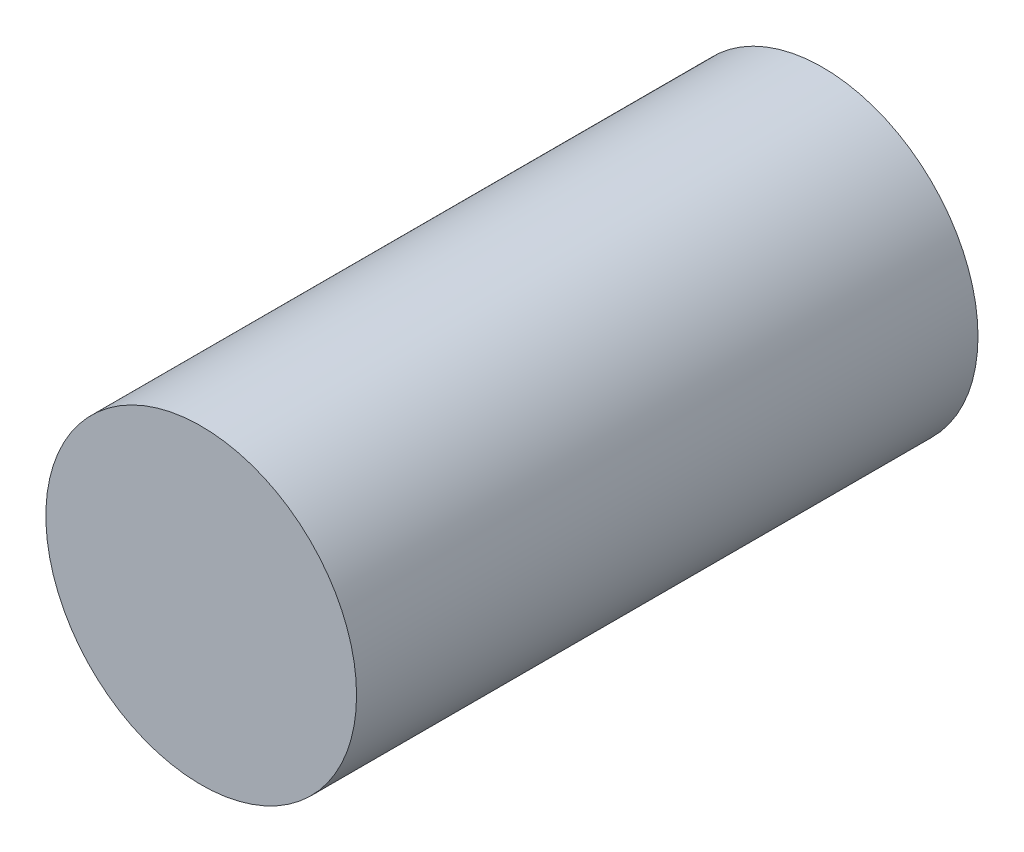
ISO-10303-21;
HEADER;
FILE_DESCRIPTION(('STEP AP214'),'2;1');
FILE_NAME('part.step','',(''),(''),'','','');
FILE_SCHEMA(('AUTOMOTIVE_DESIGN { 1 0 10303 214 1 1 1 1 }'));
ENDSEC;
DATA;
#1=APPLICATION_CONTEXT('core data for automotive mechanical design processes');
#2=APPLICATION_PROTOCOL_DEFINITION('international standard','automotive_design',2000,#1);
#3=PRODUCT_CONTEXT('',#1,'mechanical');
#4=PRODUCT('Part','Part','',(#3));
#5=PRODUCT_RELATED_PRODUCT_CATEGORY('part','',(#4));
#6=PRODUCT_DEFINITION_FORMATION('','',#4);
#7=PRODUCT_DEFINITION_CONTEXT('part definition',#1,'design');
#8=PRODUCT_DEFINITION('design','',#6,#7);
#9=PRODUCT_DEFINITION_SHAPE('','',#8);
#10=(LENGTH_UNIT() NAMED_UNIT(*) SI_UNIT(.MILLI.,.METRE.));
#11=(NAMED_UNIT(*) PLANE_ANGLE_UNIT() SI_UNIT($,.RADIAN.));
#12=(NAMED_UNIT(*) SI_UNIT($,.STERADIAN.) SOLID_ANGLE_UNIT());
#13=UNCERTAINTY_MEASURE_WITH_UNIT(LENGTH_MEASURE(1.E-05),#10,'distance_accuracy_value','');
#14=(GEOMETRIC_REPRESENTATION_CONTEXT(3) GLOBAL_UNCERTAINTY_ASSIGNED_CONTEXT((#13)) GLOBAL_UNIT_ASSIGNED_CONTEXT((#10,
#11,#12)) REPRESENTATION_CONTEXT('',''));
#15=CARTESIAN_POINT('',(0.,0.,0.));
#16=DIRECTION('',(0.,0.,1.));
#17=DIRECTION('',(1.,0.,0.));
#18=AXIS2_PLACEMENT_3D('',#15,#16,#17);
#19=CARTESIAN_POINT('',(475.,-150.,30.));
#20=DIRECTION('',(0.,0.,-1.));
#21=DIRECTION('',(-1.,0.,0.));
#22=AXIS2_PLACEMENT_3D('',#19,#20,#21);
#23=CYLINDRICAL_SURFACE('',#22,7.50000000000001);
#24=CARTESIAN_POINT('',(475.,-150.,30.));
#25=DIRECTION('',(0.,0.,1.));
#26=DIRECTION('',(1.,0.,0.));
#27=AXIS2_PLACEMENT_3D('',#24,#25,#26);
#28=CIRCLE('',#27,7.50000000000001);
#29=CARTESIAN_POINT('',(482.5,-150.,30.));
#30=VERTEX_POINT('',#29);
#31=EDGE_CURVE('E10',#30,#30,#28,.T.);
#32=ORIENTED_EDGE('',*,*,#31,.F.);
#33=EDGE_LOOP('',(#32));
#34=FACE_BOUND('',#33,.T.);
#35=CARTESIAN_POINT('',(475.,-150.,0.));
#36=DIRECTION('',(0.,0.,1.));
#37=DIRECTION('',(1.,0.,0.));
#38=AXIS2_PLACEMENT_3D('',#35,#36,#37);
#39=CIRCLE('',#38,7.50000000000001);
#40=CARTESIAN_POINT('',(482.5,-150.,0.));
#41=VERTEX_POINT('',#40);
#42=EDGE_CURVE('E33',#41,#41,#39,.T.);
#43=ORIENTED_EDGE('',*,*,#42,.T.);
#44=EDGE_LOOP('',(#43));
#45=FACE_BOUND('',#44,.T.);
#46=ADVANCED_FACE('F30',(#34,#45),#23,.T.);
#47=CARTESIAN_POINT('',(475.,-150.,30.));
#48=DIRECTION('',(0.,0.,1.));
#49=DIRECTION('',(1.,0.,0.));
#50=AXIS2_PLACEMENT_3D('',#47,#48,#49);
#51=PLANE('',#50);
#52=ORIENTED_EDGE('',*,*,#31,.T.);
#53=EDGE_LOOP('',(#52));
#54=FACE_BOUND('',#53,.T.);
#55=ADVANCED_FACE('F45',(#54),#51,.T.);
#56=CARTESIAN_POINT('',(475.,-150.,0.));
#57=DIRECTION('',(0.,0.,1.));
#58=DIRECTION('',(1.,0.,0.));
#59=AXIS2_PLACEMENT_3D('',#56,#57,#58);
#60=PLANE('',#59);
#61=ORIENTED_EDGE('',*,*,#42,.F.);
#62=EDGE_LOOP('',(#61));
#63=FACE_BOUND('',#62,.T.);
#64=ADVANCED_FACE('F43',(#63),#60,.F.);
#65=CLOSED_SHELL('',(#46,#55,#64));
#66=MANIFOLD_SOLID_BREP('B2',#65);
#67=ADVANCED_BREP_SHAPE_REPRESENTATION('',(#18,#66),#14);
#68=SHAPE_DEFINITION_REPRESENTATION(#9,#67);
ENDSEC;
END-ISO-10303-21;
